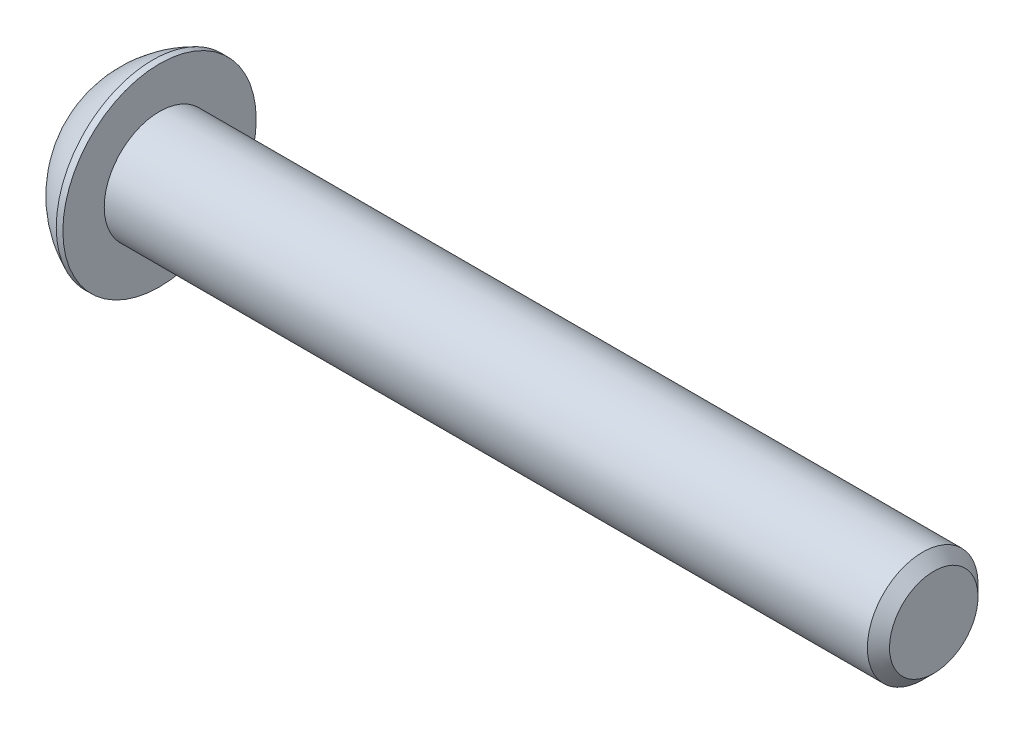
ISO-10303-21;
HEADER;
FILE_DESCRIPTION(('STEP AP214'),'2;1');
FILE_NAME('part.step','',(''),(''),'','','');
FILE_SCHEMA(('AUTOMOTIVE_DESIGN { 1 0 10303 214 1 1 1 1 }'));
ENDSEC;
DATA;
#1=APPLICATION_CONTEXT('core data for automotive mechanical design processes');
#2=APPLICATION_PROTOCOL_DEFINITION('international standard','automotive_design',2000,#1);
#3=PRODUCT_CONTEXT('',#1,'mechanical');
#4=PRODUCT('Part','Part','',(#3));
#5=PRODUCT_RELATED_PRODUCT_CATEGORY('part','',(#4));
#6=PRODUCT_DEFINITION_FORMATION('','',#4);
#7=PRODUCT_DEFINITION_CONTEXT('part definition',#1,'design');
#8=PRODUCT_DEFINITION('design','',#6,#7);
#9=PRODUCT_DEFINITION_SHAPE('','',#8);
#10=(LENGTH_UNIT() NAMED_UNIT(*) SI_UNIT(.MILLI.,.METRE.));
#11=(NAMED_UNIT(*) PLANE_ANGLE_UNIT() SI_UNIT($,.RADIAN.));
#12=(NAMED_UNIT(*) SI_UNIT($,.STERADIAN.) SOLID_ANGLE_UNIT());
#13=UNCERTAINTY_MEASURE_WITH_UNIT(LENGTH_MEASURE(1.E-05),#10,'distance_accuracy_value','');
#14=(GEOMETRIC_REPRESENTATION_CONTEXT(3) GLOBAL_UNCERTAINTY_ASSIGNED_CONTEXT((#13)) GLOBAL_UNIT_ASSIGNED_CONTEXT((#10,
#11,#12)) REPRESENTATION_CONTEXT('',''));
#15=CARTESIAN_POINT('',(0.,0.,0.));
#16=DIRECTION('',(0.,0.,1.));
#17=DIRECTION('',(1.,0.,0.));
#18=AXIS2_PLACEMENT_3D('',#15,#16,#17);
#19=CARTESIAN_POINT('',(1.32080000000034,0.,0.));
#20=DIRECTION('',(-1.,0.,0.));
#21=DIRECTION('',(0.,0.,1.));
#22=AXIS2_PLACEMENT_3D('',#19,#20,#21);
#23=CONICAL_SURFACE('',#22,1.1937999999998,1.04719755119608);
#24=CARTESIAN_POINT('',(2.01004075135902,0.,-4.44089209850063E-13));
#25=VERTEX_POINT('',#24);
#26=VERTEX_LOOP('',#25);
#27=FACE_BOUND('',#26,.T.);
#28=CARTESIAN_POINT('',(1.32080000000009,0.,0.));
#29=DIRECTION('',(-1.,0.,0.));
#30=DIRECTION('',(0.,0.,1.));
#31=AXIS2_PLACEMENT_3D('',#28,#29,#30);
#32=CIRCLE('',#31,1.19380000000024);
#33=CARTESIAN_POINT('',(1.32080000000009,0.,1.19380000000024));
#34=VERTEX_POINT('',#33);
#35=EDGE_CURVE('E20',#34,#34,#32,.T.);
#36=ORIENTED_EDGE('',*,*,#35,.T.);
#37=EDGE_LOOP('',(#36));
#38=FACE_BOUND('',#37,.T.);
#39=ADVANCED_FACE('F17',(#27,#38),#23,.F.);
#40=CARTESIAN_POINT('',(1.3208,-2.29135888084633,0.));
#41=DIRECTION('',(1.,0.,0.));
#42=DIRECTION('',(0.,0.,-1.));
#43=AXIS2_PLACEMENT_3D('',#40,#41,#42);
#44=PLANE('',#43);
#45=DIRECTION('',(0.,1.,0.));
#46=VECTOR('',#45,1.);
#47=CARTESIAN_POINT('',(1.3208,-1.14567944042316,1.984375));
#48=LINE('',#47,#46);
#49=CARTESIAN_POINT('',(1.3208,1.14567944042316,1.984375));
#50=VERTEX_POINT('',#49);
#51=CARTESIAN_POINT('',(1.3208,-1.14567944042316,1.984375));
#52=VERTEX_POINT('',#51);
#53=EDGE_CURVE('E69',#50,#52,#48,.F.);
#54=ORIENTED_EDGE('',*,*,#53,.F.);
#55=DIRECTION('',(0.,0.5,-0.866025403784439));
#56=VECTOR('',#55,1.);
#57=CARTESIAN_POINT('',(1.3208,1.14567944042316,1.984375));
#58=LINE('',#57,#56);
#59=CARTESIAN_POINT('',(1.3208,2.29135888084633,0.));
#60=VERTEX_POINT('',#59);
#61=EDGE_CURVE('E287',#60,#50,#58,.F.);
#62=ORIENTED_EDGE('',*,*,#61,.F.);
#63=DIRECTION('',(0.,-0.5,-0.866025403784439));
#64=VECTOR('',#63,1.);
#65=CARTESIAN_POINT('',(1.3208,2.29135888084633,0.));
#66=LINE('',#65,#64);
#67=CARTESIAN_POINT('',(1.3208,1.14567944042316,-1.984375));
#68=VERTEX_POINT('',#67);
#69=EDGE_CURVE('E291',#68,#60,#66,.F.);
#70=ORIENTED_EDGE('',*,*,#69,.F.);
#71=DIRECTION('',(0.,1.,0.));
#72=VECTOR('',#71,1.);
#73=CARTESIAN_POINT('',(1.3208,1.14567944042316,-1.984375));
#74=LINE('',#73,#72);
#75=CARTESIAN_POINT('',(1.3208,-1.14567944042316,-1.984375));
#76=VERTEX_POINT('',#75);
#77=EDGE_CURVE('E296',#76,#68,#74,.T.);
#78=ORIENTED_EDGE('',*,*,#77,.F.);
#79=DIRECTION('',(0.,-0.500000000000001,0.866025403784438));
#80=VECTOR('',#79,1.);
#81=CARTESIAN_POINT('',(1.3208,-1.14567944042316,-1.984375));
#82=LINE('',#81,#80);
#83=CARTESIAN_POINT('',(1.3208,-2.29135888084633,0.));
#84=VERTEX_POINT('',#83);
#85=EDGE_CURVE('E301',#84,#76,#82,.F.);
#86=ORIENTED_EDGE('',*,*,#85,.F.);
#87=DIRECTION('',(0.,0.500000000000001,0.866025403784438));
#88=VECTOR('',#87,1.);
#89=CARTESIAN_POINT('',(1.3208,-2.29135888084633,0.));
#90=LINE('',#89,#88);
#91=EDGE_CURVE('E82',#52,#84,#90,.F.);
#92=ORIENTED_EDGE('',*,*,#91,.F.);
#93=EDGE_LOOP('',(#54,#62,#70,#78,#86,#92));
#94=FACE_BOUND('',#93,.T.);
#95=ORIENTED_EDGE('',*,*,#35,.F.);
#96=EDGE_LOOP('',(#95));
#97=FACE_BOUND('',#96,.T.);
#98=ADVANCED_FACE('F75',(#94,#97),#44,.F.);
#99=CARTESIAN_POINT('',(1.3208,-1.14567944042316,1.984375));
#100=DIRECTION('',(0.,0.,-1.));
#101=DIRECTION('',(0.,1.,0.));
#102=AXIS2_PLACEMENT_3D('',#99,#100,#101);
#103=PLANE('',#102);
#104=ORIENTED_EDGE('',*,*,#53,.T.);
#105=DIRECTION('',(1.,0.,0.));
#106=VECTOR('',#105,1.);
#107=CARTESIAN_POINT('',(1.3208,-1.14567944042316,1.984375));
#108=LINE('',#107,#106);
#109=CARTESIAN_POINT('',(0.,-1.14567944042316,1.984375));
#110=VERTEX_POINT('',#109);
#111=EDGE_CURVE('E79',#110,#52,#108,.T.);
#112=ORIENTED_EDGE('',*,*,#111,.F.);
#113=DIRECTION('',(0.,1.,0.));
#114=VECTOR('',#113,1.);
#115=CARTESIAN_POINT('',(0.,0.,1.984375));
#116=LINE('',#115,#114);
#117=CARTESIAN_POINT('',(0.,1.14567944042316,1.984375));
#118=VERTEX_POINT('',#117);
#119=EDGE_CURVE('E281',#118,#110,#116,.F.);
#120=ORIENTED_EDGE('',*,*,#119,.F.);
#121=DIRECTION('',(1.,0.,0.));
#122=VECTOR('',#121,1.);
#123=CARTESIAN_POINT('',(1.3208,1.14567944042316,1.984375));
#124=LINE('',#123,#122);
#125=EDGE_CURVE('E284',#50,#118,#124,.F.);
#126=ORIENTED_EDGE('',*,*,#125,.F.);
#127=EDGE_LOOP('',(#104,#112,#120,#126));
#128=FACE_BOUND('',#127,.T.);
#129=ADVANCED_FACE('F128',(#128),#103,.T.);
#130=CARTESIAN_POINT('',(1.3208,-2.29135888084633,0.));
#131=DIRECTION('',(0.,0.866025403784438,-0.500000000000001));
#132=DIRECTION('',(0.,0.500000000000001,0.866025403784438));
#133=AXIS2_PLACEMENT_3D('',#130,#131,#132);
#134=PLANE('',#133);
#135=ORIENTED_EDGE('',*,*,#91,.T.);
#136=DIRECTION('',(1.,0.,0.));
#137=VECTOR('',#136,1.);
#138=CARTESIAN_POINT('',(1.3208,-2.29135888084633,0.));
#139=LINE('',#138,#137);
#140=CARTESIAN_POINT('',(0.,-2.29135888084633,0.));
#141=VERTEX_POINT('',#140);
#142=EDGE_CURVE('E303',#141,#84,#139,.T.);
#143=ORIENTED_EDGE('',*,*,#142,.F.);
#144=DIRECTION('',(0.,-0.500000000000001,-0.866025403784438));
#145=VECTOR('',#144,1.);
#146=CARTESIAN_POINT('',(0.,-1.14567944042316,1.984375));
#147=LINE('',#146,#145);
#148=EDGE_CURVE('E278',#110,#141,#147,.T.);
#149=ORIENTED_EDGE('',*,*,#148,.F.);
#150=ORIENTED_EDGE('',*,*,#111,.T.);
#151=EDGE_LOOP('',(#135,#143,#149,#150));
#152=FACE_BOUND('',#151,.T.);
#153=ADVANCED_FACE('F124',(#152),#134,.T.);
#154=CARTESIAN_POINT('',(1.3208,-1.14567944042316,-1.984375));
#155=DIRECTION('',(0.,0.866025403784438,0.500000000000001));
#156=DIRECTION('',(0.,-0.500000000000001,0.866025403784438));
#157=AXIS2_PLACEMENT_3D('',#154,#155,#156);
#158=PLANE('',#157);
#159=ORIENTED_EDGE('',*,*,#85,.T.);
#160=DIRECTION('',(1.,0.,0.));
#161=VECTOR('',#160,1.);
#162=CARTESIAN_POINT('',(1.3208,-1.14567944042316,-1.984375));
#163=LINE('',#162,#161);
#164=CARTESIAN_POINT('',(0.,-1.14567944042316,-1.984375));
#165=VERTEX_POINT('',#164);
#166=EDGE_CURVE('E298',#165,#76,#163,.T.);
#167=ORIENTED_EDGE('',*,*,#166,.F.);
#168=DIRECTION('',(0.,0.500000000000001,-0.866025403784438));
#169=VECTOR('',#168,1.);
#170=CARTESIAN_POINT('',(0.,-2.29135888084633,0.));
#171=LINE('',#170,#169);
#172=EDGE_CURVE('E275',#141,#165,#171,.T.);
#173=ORIENTED_EDGE('',*,*,#172,.F.);
#174=ORIENTED_EDGE('',*,*,#142,.T.);
#175=EDGE_LOOP('',(#159,#167,#173,#174));
#176=FACE_BOUND('',#175,.T.);
#177=ADVANCED_FACE('F120',(#176),#158,.T.);
#178=CARTESIAN_POINT('',(1.3208,1.14567944042316,-1.984375));
#179=DIRECTION('',(0.,0.,1.));
#180=DIRECTION('',(1.,0.,0.));
#181=AXIS2_PLACEMENT_3D('',#178,#179,#180);
#182=PLANE('',#181);
#183=ORIENTED_EDGE('',*,*,#77,.T.);
#184=DIRECTION('',(1.,0.,0.));
#185=VECTOR('',#184,1.);
#186=CARTESIAN_POINT('',(1.3208,1.14567944042316,-1.984375));
#187=LINE('',#186,#185);
#188=CARTESIAN_POINT('',(0.,1.14567944042316,-1.984375));
#189=VERTEX_POINT('',#188);
#190=EDGE_CURVE('E293',#189,#68,#187,.T.);
#191=ORIENTED_EDGE('',*,*,#190,.F.);
#192=DIRECTION('',(0.,1.,0.));
#193=VECTOR('',#192,1.);
#194=CARTESIAN_POINT('',(0.,0.,-1.984375));
#195=LINE('',#194,#193);
#196=EDGE_CURVE('E272',#165,#189,#195,.T.);
#197=ORIENTED_EDGE('',*,*,#196,.F.);
#198=ORIENTED_EDGE('',*,*,#166,.T.);
#199=EDGE_LOOP('',(#183,#191,#197,#198));
#200=FACE_BOUND('',#199,.T.);
#201=ADVANCED_FACE('F117',(#200),#182,.T.);
#202=CARTESIAN_POINT('',(1.3208,2.29135888084633,0.));
#203=DIRECTION('',(0.,-0.866025403784439,0.5));
#204=DIRECTION('',(0.,-0.5,-0.866025403784439));
#205=AXIS2_PLACEMENT_3D('',#202,#203,#204);
#206=PLANE('',#205);
#207=ORIENTED_EDGE('',*,*,#69,.T.);
#208=DIRECTION('',(1.,0.,0.));
#209=VECTOR('',#208,1.);
#210=CARTESIAN_POINT('',(1.3208,2.29135888084633,0.));
#211=LINE('',#210,#209);
#212=CARTESIAN_POINT('',(0.,2.29135888084633,0.));
#213=VERTEX_POINT('',#212);
#214=EDGE_CURVE('E35',#213,#60,#211,.T.);
#215=ORIENTED_EDGE('',*,*,#214,.F.);
#216=DIRECTION('',(0.,0.5,0.866025403784439));
#217=VECTOR('',#216,1.);
#218=CARTESIAN_POINT('',(0.,1.14567944042316,-1.984375));
#219=LINE('',#218,#217);
#220=EDGE_CURVE('E269',#189,#213,#219,.T.);
#221=ORIENTED_EDGE('',*,*,#220,.F.);
#222=ORIENTED_EDGE('',*,*,#190,.T.);
#223=EDGE_LOOP('',(#207,#215,#221,#222));
#224=FACE_BOUND('',#223,.T.);
#225=ADVANCED_FACE('F113',(#224),#206,.T.);
#226=CARTESIAN_POINT('',(1.3208,1.14567944042316,1.984375));
#227=DIRECTION('',(0.,-0.866025403784439,-0.5));
#228=DIRECTION('',(0.,0.5,-0.866025403784439));
#229=AXIS2_PLACEMENT_3D('',#226,#227,#228);
#230=PLANE('',#229);
#231=ORIENTED_EDGE('',*,*,#61,.T.);
#232=ORIENTED_EDGE('',*,*,#125,.T.);
#233=DIRECTION('',(0.,-0.5,0.866025403784438));
#234=VECTOR('',#233,1.);
#235=CARTESIAN_POINT('',(0.,2.29135888084633,0.));
#236=LINE('',#235,#234);
#237=EDGE_CURVE('E100',#213,#118,#236,.T.);
#238=ORIENTED_EDGE('',*,*,#237,.F.);
#239=ORIENTED_EDGE('',*,*,#214,.T.);
#240=EDGE_LOOP('',(#231,#232,#238,#239));
#241=FACE_BOUND('',#240,.T.);
#242=ADVANCED_FACE('F109',(#241),#230,.T.);
#243=CARTESIAN_POINT('',(0.,0.,0.));
#244=DIRECTION('',(-1.,0.,0.));
#245=DIRECTION('',(0.,0.,1.));
#246=AXIS2_PLACEMENT_3D('',#243,#244,#245);
#247=PLANE('',#246);
#248=ORIENTED_EDGE('',*,*,#220,.T.);
#249=ORIENTED_EDGE('',*,*,#237,.T.);
#250=ORIENTED_EDGE('',*,*,#119,.T.);
#251=ORIENTED_EDGE('',*,*,#148,.T.);
#252=ORIENTED_EDGE('',*,*,#172,.T.);
#253=ORIENTED_EDGE('',*,*,#196,.T.);
#254=EDGE_LOOP('',(#248,#249,#250,#251,#252,#253));
#255=FACE_BOUND('',#254,.T.);
#256=CARTESIAN_POINT('',(0.,2.77495,0.));
#257=CARTESIAN_POINT('',(0.,2.77494953309947,0.0779118937523459));
#258=CARTESIAN_POINT('',(0.,2.77166578388025,0.15583810591977));
#259=CARTESIAN_POINT('',(0.,2.75855213600204,0.311152012455904));
#260=CARTESIAN_POINT('',(0.,2.74872030471467,0.388539541019556));
#261=CARTESIAN_POINT('',(0.,2.72255472645676,0.542341518735717));
#262=CARTESIAN_POINT('',(-2.70414110576258E-13,2.70621065843663,0.618754223567578));
#263=CARTESIAN_POINT('',(2.71501725221868E-13,2.66713326915777,0.769973634286023));
#264=CARTESIAN_POINT('',(1.01274952524446E-12,2.64439476297869,0.844778983646282));
#265=CARTESIAN_POINT('',(1.81909959813207E-12,2.56690195943351,1.06566239301792));
#266=CARTESIAN_POINT('',(4.77081687541822E-13,2.50280672569928,1.20857954243987));
#267=CARTESIAN_POINT('',(-4.76232447128612E-13,2.35149826934097,1.48160874561538));
#268=CARTESIAN_POINT('',(0.,2.26428416790397,1.61172031233499));
#269=CARTESIAN_POINT('',(0.,2.1181093928834,1.79445660654268));
#270=CARTESIAN_POINT('',(0.,2.06678693791626,1.85333128513996));
#271=CARTESIAN_POINT('',(0.,1.95940522984449,1.96650727912792));
#272=CARTESIAN_POINT('',(0.,1.90335059143535,2.02081294920044));
#273=CARTESIAN_POINT('',(0.,1.78683891013963,2.12453280878582));
#274=CARTESIAN_POINT('',(0.,1.72637988450322,2.1739447713554));
#275=CARTESIAN_POINT('',(0.,1.60151968865711,2.26750481692908));
#276=CARTESIAN_POINT('',(0.,1.53711760864537,2.31165167810847));
#277=CARTESIAN_POINT('',(0.,1.33869902291632,2.43567242603944));
#278=CARTESIAN_POINT('',(0.,1.19934704110695,2.507235886628));
#279=CARTESIAN_POINT('',(0.,0.910681609121881,2.62590828672821));
#280=CARTESIAN_POINT('',(0.,0.761368265357398,2.67301748742278));
#281=CARTESIAN_POINT('',(0.,0.456932649466623,2.74151230664007));
#282=CARTESIAN_POINT('',(0.,0.301810346322584,2.76289778778721));
#283=CARTESIAN_POINT('',(0.,-0.00982263870895171,2.77931595661156));
#284=CARTESIAN_POINT('',(0.,-0.166333320596448,2.77434864428877));
#285=CARTESIAN_POINT('',(0.,-0.476280836814452,2.73822217653073));
#286=CARTESIAN_POINT('',(0.,-0.629717687555985,2.70706316096981));
#287=CARTESIAN_POINT('',(0.,-0.929254830044274,2.61937980771149));
#288=CARTESIAN_POINT('',(0.,-1.0753550434132,2.56285519909568));
#289=CARTESIAN_POINT('',(0.,-1.28570692598579,2.46037024128109));
#290=CARTESIAN_POINT('',(0.,-1.35439130022287,2.42323494812896));
#291=CARTESIAN_POINT('',(0.,-1.488391287199,2.34331277270256));
#292=CARTESIAN_POINT('',(0.,-1.55370767631787,2.30052720108831));
#293=CARTESIAN_POINT('',(0.,-1.68047292776594,2.20962421887055));
#294=CARTESIAN_POINT('',(0.,-1.7419235278682,2.16150923122348));
#295=CARTESIAN_POINT('',(0.,-1.86060297067992,2.06024311301283));
#296=CARTESIAN_POINT('',(0.,-1.91782768181715,2.0070871669763));
#297=CARTESIAN_POINT('',(0.,-2.08239462196651,1.8407220856554));
#298=CARTESIAN_POINT('',(0.,-2.18279764272601,1.72049499758422));
#299=CARTESIAN_POINT('',(0.,-2.36195754944063,1.46487629213018));
#300=CARTESIAN_POINT('',(0.,-2.44071525816758,1.32948525142807));
#301=CARTESIAN_POINT('',(0.,-2.54098882695274,1.11796734074395));
#302=CARTESIAN_POINT('',(0.,-2.57146177392727,1.04596540008347));
#303=CARTESIAN_POINT('',(0.,-2.62621251108999,0.899689259475764));
#304=CARTESIAN_POINT('',(0.,-2.65049531495563,0.825416953360952));
#305=CARTESIAN_POINT('',(0.,-2.69267708798766,0.675215808695207));
#306=CARTESIAN_POINT('',(0.,-2.71058613777937,0.599289789313092));
#307=CARTESIAN_POINT('',(0.,-2.73994710360127,0.446213628496932));
#308=CARTESIAN_POINT('',(0.,-2.75140092413871,0.369063855024788));
#309=CARTESIAN_POINT('',(0.,-2.76470470685522,0.24316208817343));
#310=CARTESIAN_POINT('',(0.,-2.76854547596618,0.194611672428577));
#311=CARTESIAN_POINT('',(0.,-2.77366826843264,0.0973760351839812));
#312=CARTESIAN_POINT('',(0.,-2.77495029178814,0.0486908136842395));
#313=CARTESIAN_POINT('',(0.,-2.77494953309947,-0.0779118937523475));
#314=CARTESIAN_POINT('',(0.,-2.77166578388025,-0.155838105919772));
#315=CARTESIAN_POINT('',(0.,-2.75855213600204,-0.311152012455906));
#316=CARTESIAN_POINT('',(0.,-2.74872030471467,-0.388539541019558));
#317=CARTESIAN_POINT('',(0.,-2.72255472645677,-0.542341518735719));
#318=CARTESIAN_POINT('',(-2.70149297926331E-13,-2.70621065843663,-0.61875422356758));
#319=CARTESIAN_POINT('',(2.712366972268E-13,-2.66713326915777,-0.769973634286024));
#320=CARTESIAN_POINT('',(1.0114146773846E-12,-2.64439476297869,-0.844778983646283));
#321=CARTESIAN_POINT('',(1.81656702958366E-12,-2.5669019594335,-1.06566239301792));
#322=CARTESIAN_POINT('',(4.7641829195856E-13,-2.50280672569928,-1.20857954243988));
#323=CARTESIAN_POINT('',(-4.75569026324205E-13,-2.35149826934097,-1.48160874561538));
#324=CARTESIAN_POINT('',(0.,-2.26428416790396,-1.61172031233499));
#325=CARTESIAN_POINT('',(0.,-2.1181093928834,-1.79445660654268));
#326=CARTESIAN_POINT('',(0.,-2.06678693791626,-1.85333128513997));
#327=CARTESIAN_POINT('',(0.,-1.95940522984449,-1.96650727912792));
#328=CARTESIAN_POINT('',(0.,-1.90335059143535,-2.02081294920044));
#329=CARTESIAN_POINT('',(0.,-1.78683891013963,-2.12453280878582));
#330=CARTESIAN_POINT('',(0.,-1.72637988450322,-2.1739447713554));
#331=CARTESIAN_POINT('',(0.,-1.60151968865711,-2.26750481692908));
#332=CARTESIAN_POINT('',(0.,-1.53711760864537,-2.31165167810847));
#333=CARTESIAN_POINT('',(0.,-1.33869902291632,-2.43567242603944));
#334=CARTESIAN_POINT('',(0.,-1.19934704110695,-2.507235886628));
#335=CARTESIAN_POINT('',(0.,-0.91068160912188,-2.62590828672821));
#336=CARTESIAN_POINT('',(0.,-0.761368265357396,-2.67301748742278));
#337=CARTESIAN_POINT('',(0.,-0.456932649466621,-2.74151230664007));
#338=CARTESIAN_POINT('',(0.,-0.301810346322582,-2.76289778778721));
#339=CARTESIAN_POINT('',(0.,0.00982263870895353,-2.77931595661156));
#340=CARTESIAN_POINT('',(0.,0.16633332059645,-2.77434864428876));
#341=CARTESIAN_POINT('',(0.,0.476280836814454,-2.73822217653073));
#342=CARTESIAN_POINT('',(0.,0.629717687555987,-2.70706316096981));
#343=CARTESIAN_POINT('',(0.,0.929254830044276,-2.6193798077115));
#344=CARTESIAN_POINT('',(0.,1.0753550434132,-2.56285519909568));
#345=CARTESIAN_POINT('',(0.,1.28570692598579,-2.46037024128109));
#346=CARTESIAN_POINT('',(0.,1.35439130022287,-2.42323494812896));
#347=CARTESIAN_POINT('',(0.,1.488391287199,-2.34331277270256));
#348=CARTESIAN_POINT('',(0.,1.55370767631787,-2.30052720108831));
#349=CARTESIAN_POINT('',(0.,1.68047292776594,-2.20962421887055));
#350=CARTESIAN_POINT('',(0.,1.7419235278682,-2.16150923122348));
#351=CARTESIAN_POINT('',(0.,1.86060297067992,-2.06024311301282));
#352=CARTESIAN_POINT('',(0.,1.91782768181716,-2.0070871669763));
#353=CARTESIAN_POINT('',(0.,2.08239462196651,-1.8407220856554));
#354=CARTESIAN_POINT('',(0.,2.18279764272601,-1.72049499758422));
#355=CARTESIAN_POINT('',(0.,2.36195754944063,-1.46487629213018));
#356=CARTESIAN_POINT('',(0.,2.44071525816757,-1.32948525142807));
#357=CARTESIAN_POINT('',(0.,2.54098882695273,-1.11796734074395));
#358=CARTESIAN_POINT('',(0.,2.57146177392727,-1.04596540008347));
#359=CARTESIAN_POINT('',(0.,2.62621251108999,-0.899689259475765));
#360=CARTESIAN_POINT('',(0.,2.65049531495563,-0.825416953360953));
#361=CARTESIAN_POINT('',(0.,2.69267708798766,-0.675215808695207));
#362=CARTESIAN_POINT('',(0.,2.71058613777936,-0.599289789313092));
#363=CARTESIAN_POINT('',(0.,2.73994710360127,-0.446213628496932));
#364=CARTESIAN_POINT('',(0.,2.75140092413871,-0.369063855024789));
#365=CARTESIAN_POINT('',(0.,2.76470470685522,-0.243162088173432));
#366=CARTESIAN_POINT('',(0.,2.76854547596618,-0.194611672428578));
#367=CARTESIAN_POINT('',(0.,2.77366826843264,-0.0973760351839823));
#368=CARTESIAN_POINT('',(0.,2.77495029178814,-0.0486908136842408));
#369=CARTESIAN_POINT('',(0.,2.77495,0.));
#370=B_SPLINE_CURVE_WITH_KNOTS('',3,(#256,#257,#258,#259,#260,#261,#262,#263,#264,#265,#266,
#267,#268,#269,#270,#271,#272,#273,#274,#275,#276,#277,#278,#279,#280,#281,#282,#283,#284,#285,
#286,#287,#288,#289,#290,#291,#292,#293,#294,#295,#296,#297,#298,#299,#300,#301,#302,#303,#304,
#305,#306,#307,#308,#309,#310,#311,#312,#313,#314,#315,#316,#317,#318,#319,#320,#321,#322,#323,
#324,#325,#326,#327,#328,#329,#330,#331,#332,#333,#334,#335,#336,#337,#338,#339,#340,#341,#342,
#343,#344,#345,#346,#347,#348,#349,#350,#351,#352,#353,#354,#355,#356,#357,#358,#359,#360,#361,
#362,#363,#364,#365,#366,#367,#368,#369),.UNSPECIFIED.,.T.,.F.,(4,2,2,2,2,2,2,2,2,2,2,2,2,2,2,2,
2,2,2,2,2,2,2,2,2,2,2,2,2,2,2,2,2,2,2,2,2,2,2,2,2,2,2,2,2,2,2,2,2,2,2,2,2,2,2,2,4),(0.,
0.233690856748162,0.467450716578751,0.701582538521471,0.935904756015414,1.40343220467667,
1.87097742791502,2.10505636898837,2.33890962270652,2.57286880998746,2.80688218486306,
3.27442101763127,3.74195485676357,4.20949119271389,4.67702752866417,5.14456136779641,
5.61210020056468,5.84611357544033,6.08007276272136,6.31392601643949,6.54800495751273,
7.01555018075072,7.48307762941212,7.71739984690652,7.95153166884955,8.18529152868023,
8.41898238542855,8.56502681353347,8.71107124163843,8.94476209838659,9.17852195821718,
9.4126537801599,9.64697599765384,10.1145034463151,10.5820486695534,10.8161276106268,
11.0499808643449,11.2839400516259,11.5179534265015,11.9854922592697,12.453026098402,
12.9205624343523,13.3880987703026,13.8556326094348,14.3231714422031,14.5571848170788,
14.7911440043598,15.0249972580779,15.2590761991512,15.7266214223891,16.1941488710506,
16.4284710885449,16.662602910488,16.8963627703186,17.130053627067,17.2760980551719,
17.4221424832769),.UNSPECIFIED.);
#371=CARTESIAN_POINT('',(0.,2.77495,0.));
#372=VERTEX_POINT('',#371);
#373=EDGE_CURVE('E94',#372,#372,#370,.T.);
#374=ORIENTED_EDGE('',*,*,#373,.F.);
#375=EDGE_LOOP('',(#374));
#376=FACE_BOUND('',#375,.T.);
#377=ADVANCED_FACE('F105',(#255,#376),#247,.T.);
#378=CARTESIAN_POINT('',(5.37260881410256,0.,0.));
#379=DIRECTION('',(0.,1.,0.));
#380=DIRECTION('',(1.,0.,0.));
#381=AXIS2_PLACEMENT_3D('',#378,#379,#380);
#382=SPHERICAL_SURFACE('',#381,6.04692260342999);
#383=CARTESIAN_POINT('',(2.9718,0.,0.));
#384=DIRECTION('',(-1.,0.,0.));
#385=DIRECTION('',(0.,0.,1.));
#386=AXIS2_PLACEMENT_3D('',#383,#384,#385);
#387=CIRCLE('',#386,5.5499);
#388=CARTESIAN_POINT('',(2.9718,0.,5.5499));
#389=VERTEX_POINT('',#388);
#390=EDGE_CURVE('E92',#389,#389,#387,.F.);
#391=ORIENTED_EDGE('',*,*,#390,.F.);
#392=EDGE_LOOP('',(#391));
#393=FACE_BOUND('',#392,.T.);
#394=ORIENTED_EDGE('',*,*,#373,.T.);
#395=EDGE_LOOP('',(#394));
#396=FACE_BOUND('',#395,.T.);
#397=ADVANCED_FACE('F101',(#393,#396),#382,.T.);
#398=CARTESIAN_POINT('',(47.8028,0.,0.));
#399=DIRECTION('',(-1.,0.,0.));
#400=DIRECTION('',(0.,0.,1.));
#401=AXIS2_PLACEMENT_3D('',#398,#399,#400);
#402=PLANE('',#401);
#403=CARTESIAN_POINT('',(47.8027999999995,0.,0.));
#404=DIRECTION('',(-1.,0.,0.));
#405=DIRECTION('',(0.,-1.,0.));
#406=AXIS2_PLACEMENT_3D('',#403,#404,#405);
#407=CIRCLE('',#406,2.54000000006727);
#408=CARTESIAN_POINT('',(47.8027999999995,-2.54000000006727,0.));
#409=VERTEX_POINT('',#408);
#410=EDGE_CURVE('E89',#409,#409,#407,.T.);
#411=ORIENTED_EDGE('',*,*,#410,.F.);
#412=EDGE_LOOP('',(#411));
#413=FACE_BOUND('',#412,.T.);
#414=ADVANCED_FACE('F154',(#413),#402,.F.);
#415=CARTESIAN_POINT('',(0.,0.,0.));
#416=DIRECTION('',(-1.,0.,0.));
#417=DIRECTION('',(0.,0.,1.));
#418=AXIS2_PLACEMENT_3D('',#415,#416,#417);
#419=CYLINDRICAL_SURFACE('',#418,5.5499);
#420=ORIENTED_EDGE('',*,*,#390,.T.);
#421=EDGE_LOOP('',(#420));
#422=FACE_BOUND('',#421,.T.);
#423=CARTESIAN_POINT('',(3.3528,0.,0.));
#424=DIRECTION('',(-1.,0.,0.));
#425=DIRECTION('',(0.,0.,1.));
#426=AXIS2_PLACEMENT_3D('',#423,#424,#425);
#427=CIRCLE('',#426,5.5499);
#428=CARTESIAN_POINT('',(3.3528,0.,5.5499));
#429=VERTEX_POINT('',#428);
#430=EDGE_CURVE('E86',#429,#429,#427,.T.);
#431=ORIENTED_EDGE('',*,*,#430,.T.);
#432=EDGE_LOOP('',(#431));
#433=FACE_BOUND('',#432,.T.);
#434=ADVANCED_FACE('F151',(#422,#433),#419,.T.);
#435=CARTESIAN_POINT('',(47.1677999999542,0.,0.));
#436=DIRECTION('',(-1.,0.,0.));
#437=DIRECTION('',(0.,-1.,0.));
#438=AXIS2_PLACEMENT_3D('',#435,#436,#437);
#439=CONICAL_SURFACE('',#438,3.1750000001125,0.785398163397448);
#440=CARTESIAN_POINT('',(47.1678,0.,0.));
#441=DIRECTION('',(-1.,0.,0.));
#442=DIRECTION('',(0.,0.,1.));
#443=AXIS2_PLACEMENT_3D('',#440,#441,#442);
#444=CIRCLE('',#443,3.175);
#445=CARTESIAN_POINT('',(47.1678,0.,3.175));
#446=VERTEX_POINT('',#445);
#447=EDGE_CURVE('E26',#446,#446,#444,.T.);
#448=ORIENTED_EDGE('',*,*,#447,.F.);
#449=EDGE_LOOP('',(#448));
#450=FACE_BOUND('',#449,.T.);
#451=ORIENTED_EDGE('',*,*,#410,.T.);
#452=EDGE_LOOP('',(#451));
#453=FACE_BOUND('',#452,.T.);
#454=ADVANCED_FACE('F144',(#450,#453),#439,.T.);
#455=CARTESIAN_POINT('',(3.3528,3.175,0.));
#456=DIRECTION('',(-1.,0.,0.));
#457=DIRECTION('',(0.,0.,1.));
#458=AXIS2_PLACEMENT_3D('',#455,#456,#457);
#459=PLANE('',#458);
#460=CARTESIAN_POINT('',(3.3528,0.,0.));
#461=DIRECTION('',(-1.,0.,0.));
#462=DIRECTION('',(0.,0.,1.));
#463=AXIS2_PLACEMENT_3D('',#460,#461,#462);
#464=CIRCLE('',#463,3.175);
#465=CARTESIAN_POINT('',(3.3528,0.,3.175));
#466=VERTEX_POINT('',#465);
#467=EDGE_CURVE('E11',#466,#466,#464,.F.);
#468=ORIENTED_EDGE('',*,*,#467,.F.);
#469=EDGE_LOOP('',(#468));
#470=FACE_BOUND('',#469,.T.);
#471=ORIENTED_EDGE('',*,*,#430,.F.);
#472=EDGE_LOOP('',(#471));
#473=FACE_BOUND('',#472,.T.);
#474=ADVANCED_FACE('F138',(#470,#473),#459,.F.);
#475=CARTESIAN_POINT('',(0.,0.,0.));
#476=DIRECTION('',(-1.,0.,0.));
#477=DIRECTION('',(0.,0.,1.));
#478=AXIS2_PLACEMENT_3D('',#475,#476,#477);
#479=CYLINDRICAL_SURFACE('',#478,3.175);
#480=ORIENTED_EDGE('',*,*,#467,.T.);
#481=EDGE_LOOP('',(#480));
#482=FACE_BOUND('',#481,.T.);
#483=ORIENTED_EDGE('',*,*,#447,.T.);
#484=EDGE_LOOP('',(#483));
#485=FACE_BOUND('',#484,.T.);
#486=ADVANCED_FACE('F136',(#482,#485),#479,.T.);
#487=CLOSED_SHELL('',(#39,#98,#129,#153,#177,#201,#225,#242,#377,#397,#414,#434,#454,#474,#486));
#488=MANIFOLD_SOLID_BREP('B1',#487);
#489=ADVANCED_BREP_SHAPE_REPRESENTATION('',(#18,#488),#14);
#490=SHAPE_DEFINITION_REPRESENTATION(#9,#489);
ENDSEC;
END-ISO-10303-21;
